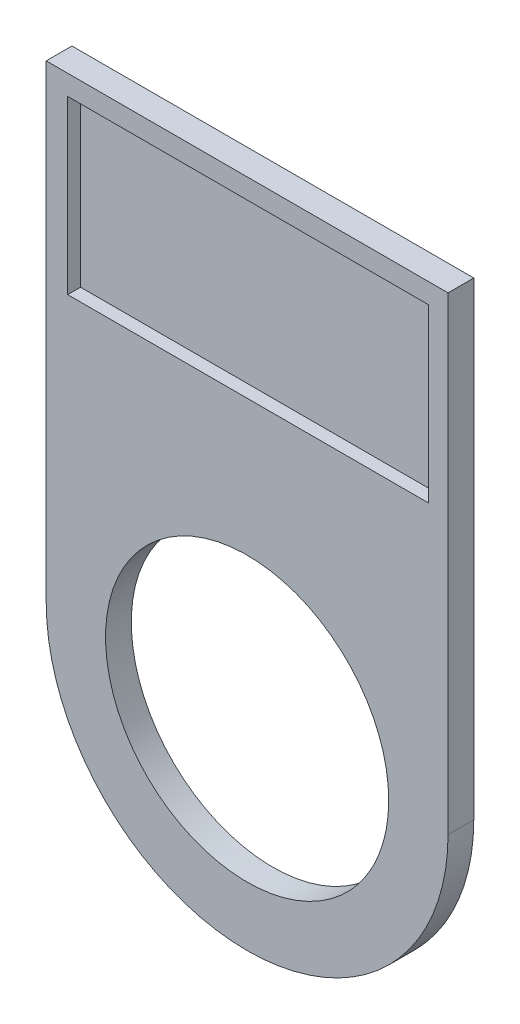
ISO-10303-21;
HEADER;
FILE_DESCRIPTION(('STEP AP214'),'2;1');
FILE_NAME('part.step','',(''),(''),'','','');
FILE_SCHEMA(('AUTOMOTIVE_DESIGN { 1 0 10303 214 1 1 1 1 }'));
ENDSEC;
DATA;
#1=APPLICATION_CONTEXT('core data for automotive mechanical design processes');
#2=APPLICATION_PROTOCOL_DEFINITION('international standard','automotive_design',2000,#1);
#3=PRODUCT_CONTEXT('',#1,'mechanical');
#4=PRODUCT('Part','Part','',(#3));
#5=PRODUCT_RELATED_PRODUCT_CATEGORY('part','',(#4));
#6=PRODUCT_DEFINITION_FORMATION('','',#4);
#7=PRODUCT_DEFINITION_CONTEXT('part definition',#1,'design');
#8=PRODUCT_DEFINITION('design','',#6,#7);
#9=PRODUCT_DEFINITION_SHAPE('','',#8);
#10=(LENGTH_UNIT() NAMED_UNIT(*) SI_UNIT(.MILLI.,.METRE.));
#11=(NAMED_UNIT(*) PLANE_ANGLE_UNIT() SI_UNIT($,.RADIAN.));
#12=(NAMED_UNIT(*) SI_UNIT($,.STERADIAN.) SOLID_ANGLE_UNIT());
#13=UNCERTAINTY_MEASURE_WITH_UNIT(LENGTH_MEASURE(1.E-05),#10,'distance_accuracy_value','');
#14=(GEOMETRIC_REPRESENTATION_CONTEXT(3) GLOBAL_UNCERTAINTY_ASSIGNED_CONTEXT((#13)) GLOBAL_UNIT_ASSIGNED_CONTEXT((#10,
#11,#12)) REPRESENTATION_CONTEXT('',''));
#15=CARTESIAN_POINT('',(0.,0.,0.));
#16=DIRECTION('',(0.,0.,1.));
#17=DIRECTION('',(1.,0.,0.));
#18=AXIS2_PLACEMENT_3D('',#15,#16,#17);
#19=CARTESIAN_POINT('',(420.808310711291,0.,2.));
#20=DIRECTION('',(-1.,0.,0.));
#21=DIRECTION('',(0.,0.,1.));
#22=AXIS2_PLACEMENT_3D('',#19,#20,#21);
#23=PLANE('',#22);
#24=DIRECTION('',(0.,1.,0.));
#25=VECTOR('',#24,1.);
#26=CARTESIAN_POINT('',(420.808310711291,0.,0.));
#27=LINE('',#26,#25);
#28=CARTESIAN_POINT('',(420.808310711291,971.79445234139,0.));
#29=VERTEX_POINT('',#28);
#30=CARTESIAN_POINT('',(420.808310711291,1008.24463044759,0.));
#31=VERTEX_POINT('',#30);
#32=EDGE_CURVE('E145',#29,#31,#27,.T.);
#33=ORIENTED_EDGE('',*,*,#32,.F.);
#34=DIRECTION('',(0.,0.,-1.));
#35=VECTOR('',#34,1.);
#36=CARTESIAN_POINT('',(420.808310711291,971.79445234139,2.));
#37=LINE('',#36,#35);
#38=CARTESIAN_POINT('',(420.808310711291,971.79445234139,2.));
#39=VERTEX_POINT('',#38);
#40=EDGE_CURVE('E11',#39,#29,#37,.T.);
#41=ORIENTED_EDGE('',*,*,#40,.F.);
#42=DIRECTION('',(0.,1.,0.));
#43=VECTOR('',#42,1.);
#44=CARTESIAN_POINT('',(420.808310711291,0.,2.));
#45=LINE('',#44,#43);
#46=CARTESIAN_POINT('',(420.808310711291,1008.24463044759,2.));
#47=VERTEX_POINT('',#46);
#48=EDGE_CURVE('E118',#39,#47,#45,.T.);
#49=ORIENTED_EDGE('',*,*,#48,.T.);
#50=DIRECTION('',(0.,0.,-1.));
#51=VECTOR('',#50,1.);
#52=CARTESIAN_POINT('',(420.808310711291,1008.24463044759,2.));
#53=LINE('',#52,#51);
#54=EDGE_CURVE('E66',#47,#31,#53,.T.);
#55=ORIENTED_EDGE('',*,*,#54,.T.);
#56=EDGE_LOOP('',(#33,#41,#49,#55));
#57=FACE_BOUND('',#56,.T.);
#58=ADVANCED_FACE('F39',(#57),#23,.T.);
#59=CARTESIAN_POINT('',(436.416309917113,971.79445234139,2.));
#60=DIRECTION('',(0.,0.,-1.));
#61=DIRECTION('',(-1.,0.,0.));
#62=AXIS2_PLACEMENT_3D('',#59,#60,#61);
#63=CYLINDRICAL_SURFACE('',#62,15.6079992058221);
#64=CARTESIAN_POINT('',(436.416309917113,971.79445234139,0.));
#65=DIRECTION('',(0.,0.,1.));
#66=DIRECTION('',(1.,0.,0.));
#67=AXIS2_PLACEMENT_3D('',#64,#65,#66);
#68=CIRCLE('',#67,15.6079992058221);
#69=CARTESIAN_POINT('',(452.024309122935,971.79445234139,0.));
#70=VERTEX_POINT('',#69);
#71=EDGE_CURVE('E125',#29,#70,#68,.T.);
#72=ORIENTED_EDGE('',*,*,#71,.T.);
#73=DIRECTION('',(0.,0.,-1.));
#74=VECTOR('',#73,1.);
#75=CARTESIAN_POINT('',(452.024309122935,971.79445234139,2.));
#76=LINE('',#75,#74);
#77=CARTESIAN_POINT('',(452.024309122935,971.79445234139,2.));
#78=VERTEX_POINT('',#77);
#79=EDGE_CURVE('E49',#78,#70,#76,.T.);
#80=ORIENTED_EDGE('',*,*,#79,.F.);
#81=CARTESIAN_POINT('',(436.416309917113,971.79445234139,2.));
#82=DIRECTION('',(0.,0.,1.));
#83=DIRECTION('',(1.,0.,0.));
#84=AXIS2_PLACEMENT_3D('',#81,#82,#83);
#85=CIRCLE('',#84,15.6079992058221);
#86=EDGE_CURVE('E112',#39,#78,#85,.T.);
#87=ORIENTED_EDGE('',*,*,#86,.F.);
#88=ORIENTED_EDGE('',*,*,#40,.T.);
#89=EDGE_LOOP('',(#72,#80,#87,#88));
#90=FACE_BOUND('',#89,.T.);
#91=ADVANCED_FACE('F123',(#90),#63,.T.);
#92=CARTESIAN_POINT('',(452.024309122935,0.,2.));
#93=DIRECTION('',(1.,0.,0.));
#94=DIRECTION('',(0.,0.,-1.));
#95=AXIS2_PLACEMENT_3D('',#92,#93,#94);
#96=PLANE('',#95);
#97=DIRECTION('',(0.,-1.,0.));
#98=VECTOR('',#97,1.);
#99=CARTESIAN_POINT('',(452.024309122935,0.,0.));
#100=LINE('',#99,#98);
#101=CARTESIAN_POINT('',(452.024309122935,1008.24463044759,0.));
#102=VERTEX_POINT('',#101);
#103=EDGE_CURVE('E151',#102,#70,#100,.T.);
#104=ORIENTED_EDGE('',*,*,#103,.F.);
#105=DIRECTION('',(0.,0.,-1.));
#106=VECTOR('',#105,1.);
#107=CARTESIAN_POINT('',(452.024309122935,1008.24463044759,2.));
#108=LINE('',#107,#106);
#109=CARTESIAN_POINT('',(452.024309122935,1008.24463044759,2.));
#110=VERTEX_POINT('',#109);
#111=EDGE_CURVE('E130',#110,#102,#108,.T.);
#112=ORIENTED_EDGE('',*,*,#111,.F.);
#113=DIRECTION('',(0.,-1.,0.));
#114=VECTOR('',#113,1.);
#115=CARTESIAN_POINT('',(452.024309122935,0.,2.));
#116=LINE('',#115,#114);
#117=EDGE_CURVE('E117',#110,#78,#116,.T.);
#118=ORIENTED_EDGE('',*,*,#117,.T.);
#119=ORIENTED_EDGE('',*,*,#79,.T.);
#120=EDGE_LOOP('',(#104,#112,#118,#119));
#121=FACE_BOUND('',#120,.T.);
#122=ADVANCED_FACE('F132',(#121),#96,.T.);
#123=CARTESIAN_POINT('',(0.,993.350590994698,2.));
#124=DIRECTION('',(0.,-1.,0.));
#125=DIRECTION('',(0.,0.,-1.));
#126=AXIS2_PLACEMENT_3D('',#123,#124,#125);
#127=PLANE('',#126);
#128=DIRECTION('',(0.,0.,-1.));
#129=VECTOR('',#128,1.);
#130=CARTESIAN_POINT('',(450.501902393997,993.350590994698,2.));
#131=LINE('',#130,#129);
#132=CARTESIAN_POINT('',(450.501902393997,993.350590994698,2.));
#133=VERTEX_POINT('',#132);
#134=CARTESIAN_POINT('',(450.501902393997,993.350590994698,1.));
#135=VERTEX_POINT('',#134);
#136=EDGE_CURVE('E137',#133,#135,#131,.T.);
#137=ORIENTED_EDGE('',*,*,#136,.T.);
#138=DIRECTION('',(1.,0.,0.));
#139=VECTOR('',#138,1.);
#140=CARTESIAN_POINT('',(422.476458289428,993.350590994698,1.));
#141=LINE('',#140,#139);
#142=CARTESIAN_POINT('',(422.476458289428,993.350590994698,1.));
#143=VERTEX_POINT('',#142);
#144=EDGE_CURVE('E57',#143,#135,#141,.T.);
#145=ORIENTED_EDGE('',*,*,#144,.F.);
#146=DIRECTION('',(0.,0.,-1.));
#147=VECTOR('',#146,1.);
#148=CARTESIAN_POINT('',(422.476458289428,993.350590994698,2.));
#149=LINE('',#148,#147);
#150=CARTESIAN_POINT('',(422.476458289428,993.350590994698,2.));
#151=VERTEX_POINT('',#150);
#152=EDGE_CURVE('E43',#151,#143,#149,.T.);
#153=ORIENTED_EDGE('',*,*,#152,.F.);
#154=DIRECTION('',(-1.,0.,0.));
#155=VECTOR('',#154,1.);
#156=CARTESIAN_POINT('',(0.,993.350590994698,2.));
#157=LINE('',#156,#155);
#158=EDGE_CURVE('E158',#133,#151,#157,.T.);
#159=ORIENTED_EDGE('',*,*,#158,.F.);
#160=EDGE_LOOP('',(#137,#145,#153,#159));
#161=FACE_BOUND('',#160,.T.);
#162=ADVANCED_FACE('F41',(#161),#127,.F.);
#163=CARTESIAN_POINT('',(422.476458289428,0.,2.));
#164=DIRECTION('',(-1.,0.,0.));
#165=DIRECTION('',(0.,0.,1.));
#166=AXIS2_PLACEMENT_3D('',#163,#164,#165);
#167=PLANE('',#166);
#168=ORIENTED_EDGE('',*,*,#152,.T.);
#169=DIRECTION('',(0.,-1.,0.));
#170=VECTOR('',#169,1.);
#171=CARTESIAN_POINT('',(422.476458289428,1006.68886247231,1.));
#172=LINE('',#171,#170);
#173=CARTESIAN_POINT('',(422.476458289428,1006.68886247231,1.));
#174=VERTEX_POINT('',#173);
#175=EDGE_CURVE('E180',#174,#143,#172,.T.);
#176=ORIENTED_EDGE('',*,*,#175,.F.);
#177=DIRECTION('',(0.,0.,-1.));
#178=VECTOR('',#177,1.);
#179=CARTESIAN_POINT('',(422.476458289428,1006.68886247231,2.));
#180=LINE('',#179,#178);
#181=CARTESIAN_POINT('',(422.476458289428,1006.68886247231,2.));
#182=VERTEX_POINT('',#181);
#183=EDGE_CURVE('E169',#182,#174,#180,.T.);
#184=ORIENTED_EDGE('',*,*,#183,.F.);
#185=DIRECTION('',(0.,1.,0.));
#186=VECTOR('',#185,1.);
#187=CARTESIAN_POINT('',(422.476458289428,0.,2.));
#188=LINE('',#187,#186);
#189=EDGE_CURVE('E93',#151,#182,#188,.T.);
#190=ORIENTED_EDGE('',*,*,#189,.F.);
#191=EDGE_LOOP('',(#168,#176,#184,#190));
#192=FACE_BOUND('',#191,.T.);
#193=ADVANCED_FACE('F179',(#192),#167,.F.);
#194=CARTESIAN_POINT('',(0.,1006.68886247231,2.));
#195=DIRECTION('',(0.,1.,0.));
#196=DIRECTION('',(0.,0.,1.));
#197=AXIS2_PLACEMENT_3D('',#194,#195,#196);
#198=PLANE('',#197);
#199=ORIENTED_EDGE('',*,*,#183,.T.);
#200=DIRECTION('',(-1.,0.,0.));
#201=VECTOR('',#200,1.);
#202=CARTESIAN_POINT('',(422.476458289428,1006.68886247231,1.));
#203=LINE('',#202,#201);
#204=CARTESIAN_POINT('',(450.501902393997,1006.68886247231,1.));
#205=VERTEX_POINT('',#204);
#206=EDGE_CURVE('E146',#205,#174,#203,.T.);
#207=ORIENTED_EDGE('',*,*,#206,.F.);
#208=DIRECTION('',(0.,0.,-1.));
#209=VECTOR('',#208,1.);
#210=CARTESIAN_POINT('',(450.501902393997,1006.68886247231,2.));
#211=LINE('',#210,#209);
#212=CARTESIAN_POINT('',(450.501902393997,1006.68886247231,2.));
#213=VERTEX_POINT('',#212);
#214=EDGE_CURVE('E166',#213,#205,#211,.T.);
#215=ORIENTED_EDGE('',*,*,#214,.F.);
#216=DIRECTION('',(1.,0.,0.));
#217=VECTOR('',#216,1.);
#218=CARTESIAN_POINT('',(0.,1006.68886247231,2.));
#219=LINE('',#218,#217);
#220=EDGE_CURVE('E201',#182,#213,#219,.T.);
#221=ORIENTED_EDGE('',*,*,#220,.F.);
#222=EDGE_LOOP('',(#199,#207,#215,#221));
#223=FACE_BOUND('',#222,.T.);
#224=ADVANCED_FACE('F238',(#223),#198,.F.);
#225=CARTESIAN_POINT('',(436.416309917113,971.79445234139,2.));
#226=DIRECTION('',(0.,0.,-1.));
#227=DIRECTION('',(-1.,0.,0.));
#228=AXIS2_PLACEMENT_3D('',#225,#226,#227);
#229=CYLINDRICAL_SURFACE('',#228,11.);
#230=CARTESIAN_POINT('',(436.416309917113,971.79445234139,2.));
#231=DIRECTION('',(0.,0.,1.));
#232=DIRECTION('',(1.,0.,0.));
#233=AXIS2_PLACEMENT_3D('',#230,#231,#232);
#234=CIRCLE('',#233,11.);
#235=CARTESIAN_POINT('',(447.416309917113,971.79445234139,2.));
#236=VERTEX_POINT('',#235);
#237=EDGE_CURVE('E207',#236,#236,#234,.T.);
#238=ORIENTED_EDGE('',*,*,#237,.T.);
#239=EDGE_LOOP('',(#238));
#240=FACE_BOUND('',#239,.T.);
#241=CARTESIAN_POINT('',(436.416309917113,971.79445234139,0.));
#242=DIRECTION('',(0.,0.,1.));
#243=DIRECTION('',(1.,0.,0.));
#244=AXIS2_PLACEMENT_3D('',#241,#242,#243);
#245=CIRCLE('',#244,11.);
#246=CARTESIAN_POINT('',(447.416309917113,971.79445234139,0.));
#247=VERTEX_POINT('',#246);
#248=EDGE_CURVE('E141',#247,#247,#245,.T.);
#249=ORIENTED_EDGE('',*,*,#248,.F.);
#250=EDGE_LOOP('',(#249));
#251=FACE_BOUND('',#250,.T.);
#252=ADVANCED_FACE('F234',(#240,#251),#229,.F.);
#253=CARTESIAN_POINT('',(450.501902393997,0.,2.));
#254=DIRECTION('',(1.,0.,0.));
#255=DIRECTION('',(0.,0.,-1.));
#256=AXIS2_PLACEMENT_3D('',#253,#254,#255);
#257=PLANE('',#256);
#258=ORIENTED_EDGE('',*,*,#214,.T.);
#259=DIRECTION('',(0.,1.,0.));
#260=VECTOR('',#259,1.);
#261=CARTESIAN_POINT('',(450.501902393997,1006.68886247231,1.));
#262=LINE('',#261,#260);
#263=EDGE_CURVE('E187',#135,#205,#262,.T.);
#264=ORIENTED_EDGE('',*,*,#263,.F.);
#265=ORIENTED_EDGE('',*,*,#136,.F.);
#266=DIRECTION('',(0.,-1.,0.));
#267=VECTOR('',#266,1.);
#268=CARTESIAN_POINT('',(450.501902393997,0.,2.));
#269=LINE('',#268,#267);
#270=EDGE_CURVE('E204',#213,#133,#269,.T.);
#271=ORIENTED_EDGE('',*,*,#270,.F.);
#272=EDGE_LOOP('',(#258,#264,#265,#271));
#273=FACE_BOUND('',#272,.T.);
#274=ADVANCED_FACE('F237',(#273),#257,.F.);
#275=CARTESIAN_POINT('',(0.,1008.24463044759,2.));
#276=DIRECTION('',(0.,1.,0.));
#277=DIRECTION('',(0.,0.,1.));
#278=AXIS2_PLACEMENT_3D('',#275,#276,#277);
#279=PLANE('',#278);
#280=DIRECTION('',(1.,0.,0.));
#281=VECTOR('',#280,1.);
#282=CARTESIAN_POINT('',(0.,1008.24463044759,0.));
#283=LINE('',#282,#281);
#284=EDGE_CURVE('E154',#31,#102,#283,.T.);
#285=ORIENTED_EDGE('',*,*,#284,.F.);
#286=ORIENTED_EDGE('',*,*,#54,.F.);
#287=DIRECTION('',(1.,0.,0.));
#288=VECTOR('',#287,1.);
#289=CARTESIAN_POINT('',(0.,1008.24463044759,2.));
#290=LINE('',#289,#288);
#291=EDGE_CURVE('E134',#47,#110,#290,.T.);
#292=ORIENTED_EDGE('',*,*,#291,.T.);
#293=ORIENTED_EDGE('',*,*,#111,.T.);
#294=EDGE_LOOP('',(#285,#286,#292,#293));
#295=FACE_BOUND('',#294,.T.);
#296=ADVANCED_FACE('F211',(#295),#279,.T.);
#297=CARTESIAN_POINT('',(0.,0.,2.));
#298=DIRECTION('',(0.,0.,1.));
#299=DIRECTION('',(1.,0.,0.));
#300=AXIS2_PLACEMENT_3D('',#297,#298,#299);
#301=PLANE('',#300);
#302=ORIENTED_EDGE('',*,*,#158,.T.);
#303=ORIENTED_EDGE('',*,*,#189,.T.);
#304=ORIENTED_EDGE('',*,*,#220,.T.);
#305=ORIENTED_EDGE('',*,*,#270,.T.);
#306=EDGE_LOOP('',(#302,#303,#304,#305));
#307=FACE_BOUND('',#306,.T.);
#308=ORIENTED_EDGE('',*,*,#237,.F.);
#309=EDGE_LOOP('',(#308));
#310=FACE_BOUND('',#309,.T.);
#311=ORIENTED_EDGE('',*,*,#48,.F.);
#312=ORIENTED_EDGE('',*,*,#86,.T.);
#313=ORIENTED_EDGE('',*,*,#117,.F.);
#314=ORIENTED_EDGE('',*,*,#291,.F.);
#315=EDGE_LOOP('',(#311,#312,#313,#314));
#316=FACE_BOUND('',#315,.T.);
#317=ADVANCED_FACE('F114',(#307,#310,#316),#301,.T.);
#318=CARTESIAN_POINT('',(0.,0.,0.));
#319=DIRECTION('',(0.,0.,1.));
#320=DIRECTION('',(1.,0.,0.));
#321=AXIS2_PLACEMENT_3D('',#318,#319,#320);
#322=PLANE('',#321);
#323=ORIENTED_EDGE('',*,*,#248,.T.);
#324=EDGE_LOOP('',(#323));
#325=FACE_BOUND('',#324,.T.);
#326=ORIENTED_EDGE('',*,*,#32,.T.);
#327=ORIENTED_EDGE('',*,*,#284,.T.);
#328=ORIENTED_EDGE('',*,*,#103,.T.);
#329=ORIENTED_EDGE('',*,*,#71,.F.);
#330=EDGE_LOOP('',(#326,#327,#328,#329));
#331=FACE_BOUND('',#330,.T.);
#332=ADVANCED_FACE('F213',(#325,#331),#322,.F.);
#333=CARTESIAN_POINT('',(0.,0.,1.));
#334=DIRECTION('',(0.,0.,1.));
#335=DIRECTION('',(1.,0.,0.));
#336=AXIS2_PLACEMENT_3D('',#333,#334,#335);
#337=PLANE('',#336);
#338=ORIENTED_EDGE('',*,*,#175,.T.);
#339=ORIENTED_EDGE('',*,*,#144,.T.);
#340=ORIENTED_EDGE('',*,*,#263,.T.);
#341=ORIENTED_EDGE('',*,*,#206,.T.);
#342=EDGE_LOOP('',(#338,#339,#340,#341));
#343=FACE_BOUND('',#342,.T.);
#344=ADVANCED_FACE('F215',(#343),#337,.T.);
#345=CLOSED_SHELL('',(#58,#91,#122,#162,#193,#224,#252,#274,#296,#317,#332,#344));
#346=MANIFOLD_SOLID_BREP('B2',#345);
#347=ADVANCED_BREP_SHAPE_REPRESENTATION('',(#18,#346),#14);
#348=SHAPE_DEFINITION_REPRESENTATION(#9,#347);
ENDSEC;
END-ISO-10303-21;
